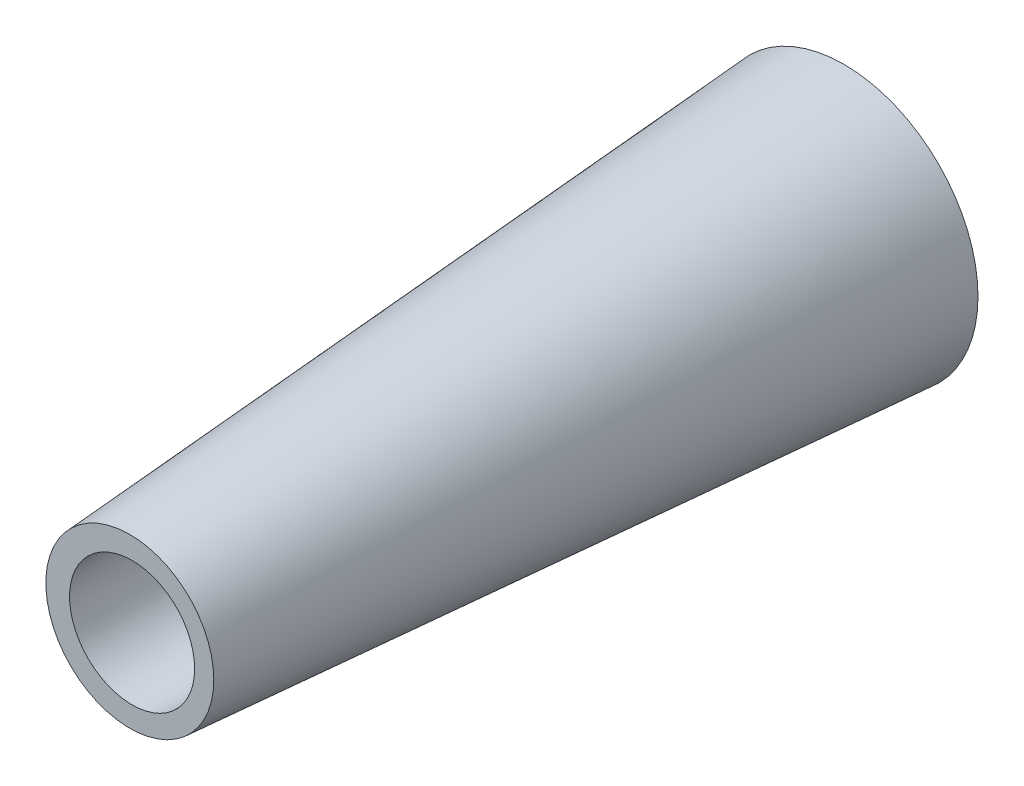
ISO-10303-21;
HEADER;
FILE_DESCRIPTION(('STEP AP214'),'2;1');
FILE_NAME('part.step','',(''),(''),'','','');
FILE_SCHEMA(('AUTOMOTIVE_DESIGN { 1 0 10303 214 1 1 1 1 }'));
ENDSEC;
DATA;
#1=APPLICATION_CONTEXT('core data for automotive mechanical design processes');
#2=APPLICATION_PROTOCOL_DEFINITION('international standard','automotive_design',2000,#1);
#3=PRODUCT_CONTEXT('',#1,'mechanical');
#4=PRODUCT('Part','Part','',(#3));
#5=PRODUCT_RELATED_PRODUCT_CATEGORY('part','',(#4));
#6=PRODUCT_DEFINITION_FORMATION('','',#4);
#7=PRODUCT_DEFINITION_CONTEXT('part definition',#1,'design');
#8=PRODUCT_DEFINITION('design','',#6,#7);
#9=PRODUCT_DEFINITION_SHAPE('','',#8);
#10=(LENGTH_UNIT() NAMED_UNIT(*) SI_UNIT(.MILLI.,.METRE.));
#11=(NAMED_UNIT(*) PLANE_ANGLE_UNIT() SI_UNIT($,.RADIAN.));
#12=(NAMED_UNIT(*) SI_UNIT($,.STERADIAN.) SOLID_ANGLE_UNIT());
#13=UNCERTAINTY_MEASURE_WITH_UNIT(LENGTH_MEASURE(1.E-05),#10,'distance_accuracy_value','');
#14=(GEOMETRIC_REPRESENTATION_CONTEXT(3) GLOBAL_UNCERTAINTY_ASSIGNED_CONTEXT((#13)) GLOBAL_UNIT_ASSIGNED_CONTEXT((#10,
#11,#12)) REPRESENTATION_CONTEXT('',''));
#15=CARTESIAN_POINT('',(0.,0.,0.));
#16=DIRECTION('',(0.,0.,1.));
#17=DIRECTION('',(1.,0.,0.));
#18=AXIS2_PLACEMENT_3D('',#15,#16,#17);
#19=CARTESIAN_POINT('',(0.,0.,0.));
#20=DIRECTION('',(0.,0.,-1.));
#21=DIRECTION('',(1.,0.,0.));
#22=AXIS2_PLACEMENT_3D('',#19,#20,#21);
#23=CONICAL_SURFACE('',#22,7.5,0.0698131700797732);
#24=CARTESIAN_POINT('',(0.,0.,40.));
#25=DIRECTION('',(0.,0.,1.));
#26=DIRECTION('',(1.,0.,0.));
#27=AXIS2_PLACEMENT_3D('',#24,#25,#26);
#28=CIRCLE('',#27,4.70292752225958);
#29=CARTESIAN_POINT('',(4.70292752225958,0.,40.));
#30=VERTEX_POINT('',#29);
#31=EDGE_CURVE('E10',#30,#30,#28,.T.);
#32=ORIENTED_EDGE('',*,*,#31,.F.);
#33=EDGE_LOOP('',(#32));
#34=FACE_BOUND('',#33,.T.);
#35=CARTESIAN_POINT('',(0.,0.,0.));
#36=DIRECTION('',(0.,0.,1.));
#37=DIRECTION('',(1.,0.,0.));
#38=AXIS2_PLACEMENT_3D('',#35,#36,#37);
#39=CIRCLE('',#38,7.5);
#40=CARTESIAN_POINT('',(7.5,0.,0.));
#41=VERTEX_POINT('',#40);
#42=EDGE_CURVE('E37',#41,#41,#39,.T.);
#43=ORIENTED_EDGE('',*,*,#42,.T.);
#44=EDGE_LOOP('',(#43));
#45=FACE_BOUND('',#44,.T.);
#46=ADVANCED_FACE('F31',(#34,#45),#23,.T.);
#47=CARTESIAN_POINT('',(0.,0.,40.));
#48=DIRECTION('',(0.,0.,1.));
#49=DIRECTION('',(1.,0.,0.));
#50=AXIS2_PLACEMENT_3D('',#47,#48,#49);
#51=PLANE('',#50);
#52=CARTESIAN_POINT('',(0.126687282741297,0.0024643815412734,40.));
#53=DIRECTION('',(0.,0.,1.));
#54=DIRECTION('',(1.,0.,0.));
#55=AXIS2_PLACEMENT_3D('',#52,#53,#54);
#56=CIRCLE('',#55,3.50275489681135);
#57=CARTESIAN_POINT('',(3.62944217955264,0.0024643815412734,40.));
#58=VERTEX_POINT('',#57);
#59=EDGE_CURVE('E45',#58,#58,#56,.T.);
#60=ORIENTED_EDGE('',*,*,#59,.F.);
#61=EDGE_LOOP('',(#60));
#62=FACE_BOUND('',#61,.T.);
#63=ORIENTED_EDGE('',*,*,#31,.T.);
#64=EDGE_LOOP('',(#63));
#65=FACE_BOUND('',#64,.T.);
#66=ADVANCED_FACE('F53',(#62,#65),#51,.T.);
#67=CARTESIAN_POINT('',(0.,0.,0.));
#68=DIRECTION('',(0.,0.,1.));
#69=DIRECTION('',(1.,0.,0.));
#70=AXIS2_PLACEMENT_3D('',#67,#68,#69);
#71=PLANE('',#70);
#72=ORIENTED_EDGE('',*,*,#42,.F.);
#73=EDGE_LOOP('',(#72));
#74=FACE_BOUND('',#73,.T.);
#75=ADVANCED_FACE('F55',(#74),#71,.F.);
#76=CARTESIAN_POINT('',(0.126687282741297,0.0024643815412734,5.));
#77=DIRECTION('',(0.,0.,1.));
#78=DIRECTION('',(1.,0.,0.));
#79=AXIS2_PLACEMENT_3D('',#76,#77,#78);
#80=CYLINDRICAL_SURFACE('',#79,3.50275489681135);
#81=CARTESIAN_POINT('',(0.126687282741297,0.0024643815412734,5.));
#82=DIRECTION('',(0.,0.,1.));
#83=DIRECTION('',(1.,0.,0.));
#84=AXIS2_PLACEMENT_3D('',#81,#82,#83);
#85=CIRCLE('',#84,3.50275489681135);
#86=CARTESIAN_POINT('',(3.62944217955264,0.0024643815412734,5.));
#87=VERTEX_POINT('',#86);
#88=EDGE_CURVE('E41',#87,#87,#85,.T.);
#89=ORIENTED_EDGE('',*,*,#88,.F.);
#90=EDGE_LOOP('',(#89));
#91=FACE_BOUND('',#90,.T.);
#92=ORIENTED_EDGE('',*,*,#59,.T.);
#93=EDGE_LOOP('',(#92));
#94=FACE_BOUND('',#93,.T.);
#95=ADVANCED_FACE('F51',(#91,#94),#80,.F.);
#96=CARTESIAN_POINT('',(0.,0.,5.));
#97=DIRECTION('',(0.,0.,1.));
#98=DIRECTION('',(1.,0.,0.));
#99=AXIS2_PLACEMENT_3D('',#96,#97,#98);
#100=PLANE('',#99);
#101=ORIENTED_EDGE('',*,*,#88,.T.);
#102=EDGE_LOOP('',(#101));
#103=FACE_BOUND('',#102,.T.);
#104=ADVANCED_FACE('F66',(#103),#100,.T.);
#105=CLOSED_SHELL('',(#46,#66,#75,#95,#104));
#106=MANIFOLD_SOLID_BREP('B2',#105);
#107=ADVANCED_BREP_SHAPE_REPRESENTATION('',(#18,#106),#14);
#108=SHAPE_DEFINITION_REPRESENTATION(#9,#107);
ENDSEC;
END-ISO-10303-21;
